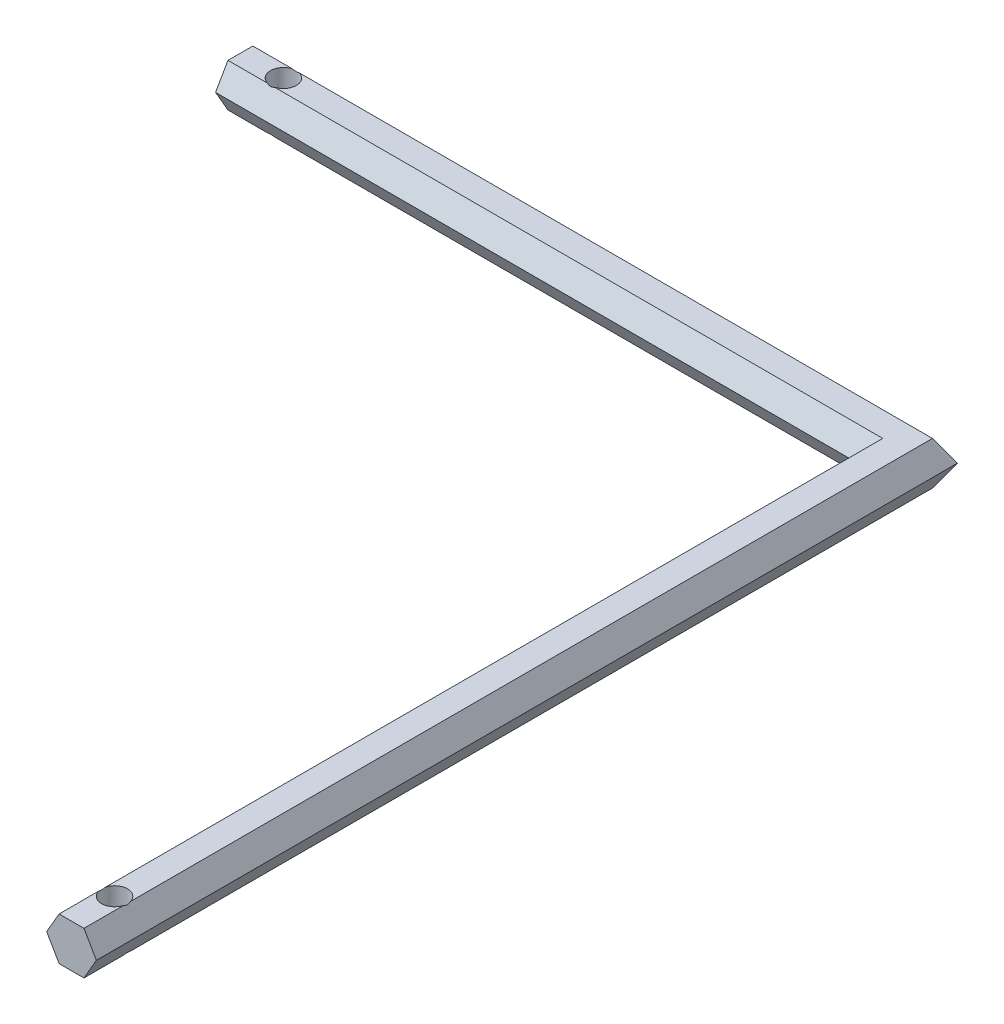
ISO-10303-21;
HEADER;
FILE_DESCRIPTION(('STEP AP214'),'2;1');
FILE_NAME('part.step','',(''),(''),'','','');
FILE_SCHEMA(('AUTOMOTIVE_DESIGN { 1 0 10303 214 1 1 1 1 }'));
ENDSEC;
DATA;
#1=APPLICATION_CONTEXT('core data for automotive mechanical design processes');
#2=APPLICATION_PROTOCOL_DEFINITION('international standard','automotive_design',2000,#1);
#3=PRODUCT_CONTEXT('',#1,'mechanical');
#4=PRODUCT('Part','Part','',(#3));
#5=PRODUCT_RELATED_PRODUCT_CATEGORY('part','',(#4));
#6=PRODUCT_DEFINITION_FORMATION('','',#4);
#7=PRODUCT_DEFINITION_CONTEXT('part definition',#1,'design');
#8=PRODUCT_DEFINITION('design','',#6,#7);
#9=PRODUCT_DEFINITION_SHAPE('','',#8);
#10=(LENGTH_UNIT() NAMED_UNIT(*) SI_UNIT(.MILLI.,.METRE.));
#11=(NAMED_UNIT(*) PLANE_ANGLE_UNIT() SI_UNIT($,.RADIAN.));
#12=(NAMED_UNIT(*) SI_UNIT($,.STERADIAN.) SOLID_ANGLE_UNIT());
#13=UNCERTAINTY_MEASURE_WITH_UNIT(LENGTH_MEASURE(1.E-05),#10,'distance_accuracy_value','');
#14=(GEOMETRIC_REPRESENTATION_CONTEXT(3) GLOBAL_UNCERTAINTY_ASSIGNED_CONTEXT((#13)) GLOBAL_UNIT_ASSIGNED_CONTEXT((#10,
#11,#12)) REPRESENTATION_CONTEXT('',''));
#15=CARTESIAN_POINT('',(0.,0.,0.));
#16=DIRECTION('',(0.,0.,1.));
#17=DIRECTION('',(1.,0.,0.));
#18=AXIS2_PLACEMENT_3D('',#15,#16,#17);
#19=CARTESIAN_POINT('',(-2.88675134594812,-5.00000000000001,100.));
#20=DIRECTION('',(0.,1.,0.));
#21=DIRECTION('',(-1.,0.,0.));
#22=AXIS2_PLACEMENT_3D('',#19,#20,#21);
#23=PLANE('',#22);
#24=DIRECTION('',(0.,0.,-1.));
#25=VECTOR('',#24,1.);
#26=CARTESIAN_POINT('',(-2.88675134594812,-5.00000000000001,100.));
#27=LINE('',#26,#25);
#28=CARTESIAN_POINT('',(-2.88675134594812,-5.00000000000001,100.));
#29=VERTEX_POINT('',#28);
#30=CARTESIAN_POINT('',(-2.88675134594812,-5.00000000000001,90.8164965809277));
#31=VERTEX_POINT('',#30);
#32=EDGE_CURVE('E358',#29,#31,#27,.T.);
#33=ORIENTED_EDGE('',*,*,#32,.T.);
#34=CARTESIAN_POINT('',(0.,-5.,90.));
#35=DIRECTION('',(0.,1.,0.));
#36=DIRECTION('',(-1.,0.,0.));
#37=AXIS2_PLACEMENT_3D('',#34,#35,#36);
#38=CIRCLE('',#37,3.);
#39=CARTESIAN_POINT('',(2.88675134594815,-4.99999999999999,90.8164965809277));
#40=VERTEX_POINT('',#39);
#41=EDGE_CURVE('E447',#31,#40,#38,.T.);
#42=ORIENTED_EDGE('',*,*,#41,.T.);
#43=DIRECTION('',(0.,0.,-1.));
#44=VECTOR('',#43,1.);
#45=CARTESIAN_POINT('',(2.88675134594815,-4.99999999999999,100.));
#46=LINE('',#45,#44);
#47=CARTESIAN_POINT('',(2.88675134594815,-4.99999999999999,100.));
#48=VERTEX_POINT('',#47);
#49=EDGE_CURVE('E352',#48,#40,#46,.T.);
#50=ORIENTED_EDGE('',*,*,#49,.F.);
#51=DIRECTION('',(1.,0.,0.));
#52=VECTOR('',#51,1.);
#53=CARTESIAN_POINT('',(-2.88675134594812,-5.00000000000001,100.));
#54=LINE('',#53,#52);
#55=EDGE_CURVE('E406',#29,#48,#54,.T.);
#56=ORIENTED_EDGE('',*,*,#55,.F.);
#57=EDGE_LOOP('',(#33,#42,#50,#56));
#58=FACE_BOUND('',#57,.T.);
#59=ADVANCED_FACE('F51',(#58),#23,.F.);
#60=CARTESIAN_POINT('',(2.88675134594815,-4.99999999999999,89.1835034190723));
#61=VERTEX_POINT('',#60);
#62=CARTESIAN_POINT('',(2.88675134594814,-5.00000000000001,-97.1132486540519));
#63=VERTEX_POINT('',#62);
#64=EDGE_CURVE('E351',#61,#63,#46,.T.);
#65=ORIENTED_EDGE('',*,*,#64,.F.);
#66=CARTESIAN_POINT('',(-2.88675134594812,-5.00000000000001,89.1835034190723));
#67=VERTEX_POINT('',#66);
#68=EDGE_CURVE('E70',#61,#67,#38,.T.);
#69=ORIENTED_EDGE('',*,*,#68,.T.);
#70=CARTESIAN_POINT('',(-2.88675134594811,-5.00000000000001,-91.3397459621557));
#71=VERTEX_POINT('',#70);
#72=EDGE_CURVE('E55',#67,#71,#27,.T.);
#73=ORIENTED_EDGE('',*,*,#72,.T.);
#74=DIRECTION('',(1.,0.,0.));
#75=VECTOR('',#74,1.);
#76=CARTESIAN_POINT('',(-154.999999999999,-5.00000000000002,-91.3397459621568));
#77=LINE('',#76,#75);
#78=CARTESIAN_POINT('',(-144.183503419071,-5.00000000000052,-91.3397459621567));
#79=VERTEX_POINT('',#78);
#80=EDGE_CURVE('E238',#79,#71,#77,.T.);
#81=ORIENTED_EDGE('',*,*,#80,.F.);
#82=CARTESIAN_POINT('',(-145.,-5.00000000000052,-94.2264973081045));
#83=DIRECTION('',(0.,1.,0.));
#84=DIRECTION('',(-1.,0.,0.));
#85=AXIS2_PLACEMENT_3D('',#82,#83,#84);
#86=CIRCLE('',#85,2.99999999999999);
#87=CARTESIAN_POINT('',(-144.183503419073,-5.00000000000002,-97.1132486540529));
#88=VERTEX_POINT('',#87);
#89=EDGE_CURVE('E453',#79,#88,#86,.T.);
#90=ORIENTED_EDGE('',*,*,#89,.T.);
#91=DIRECTION('',(1.,0.,0.));
#92=VECTOR('',#91,1.);
#93=CARTESIAN_POINT('',(-154.999999999999,-5.00000000000002,-97.113248654053));
#94=LINE('',#93,#92);
#95=EDGE_CURVE('E231',#88,#63,#94,.T.);
#96=ORIENTED_EDGE('',*,*,#95,.T.);
#97=EDGE_LOOP('',(#65,#69,#73,#81,#90,#96));
#98=FACE_BOUND('',#97,.T.);
#99=ADVANCED_FACE('F294',(#98),#23,.F.);
#100=CARTESIAN_POINT('',(2.88675134594808,5.00000000000003,100.));
#101=DIRECTION('',(0.,-1.,0.));
#102=DIRECTION('',(1.,0.,0.));
#103=AXIS2_PLACEMENT_3D('',#100,#101,#102);
#104=PLANE('',#103);
#105=DIRECTION('',(0.,0.,-1.));
#106=VECTOR('',#105,1.);
#107=CARTESIAN_POINT('',(2.88675134594808,5.00000000000003,100.));
#108=LINE('',#107,#106);
#109=CARTESIAN_POINT('',(2.88675134594808,5.00000000000003,100.));
#110=VERTEX_POINT('',#109);
#111=CARTESIAN_POINT('',(2.88675134594808,5.00000000000003,90.816496580928));
#112=VERTEX_POINT('',#111);
#113=EDGE_CURVE('E339',#110,#112,#108,.T.);
#114=ORIENTED_EDGE('',*,*,#113,.T.);
#115=CARTESIAN_POINT('',(0.,5.,90.));
#116=DIRECTION('',(0.,-1.,0.));
#117=DIRECTION('',(1.,0.,0.));
#118=AXIS2_PLACEMENT_3D('',#115,#116,#117);
#119=CIRCLE('',#118,3.);
#120=CARTESIAN_POINT('',(-2.88675134594819,4.99999999999997,90.8164965809274));
#121=VERTEX_POINT('',#120);
#122=EDGE_CURVE('E12',#112,#121,#119,.T.);
#123=ORIENTED_EDGE('',*,*,#122,.T.);
#124=DIRECTION('',(0.,0.,-1.));
#125=VECTOR('',#124,1.);
#126=CARTESIAN_POINT('',(-2.88675134594819,4.99999999999997,100.));
#127=LINE('',#126,#125);
#128=CARTESIAN_POINT('',(-2.88675134594819,4.99999999999997,100.));
#129=VERTEX_POINT('',#128);
#130=EDGE_CURVE('E340',#129,#121,#127,.T.);
#131=ORIENTED_EDGE('',*,*,#130,.F.);
#132=DIRECTION('',(-1.,0.,0.));
#133=VECTOR('',#132,1.);
#134=CARTESIAN_POINT('',(2.88675134594808,5.00000000000003,100.));
#135=LINE('',#134,#133);
#136=EDGE_CURVE('E421',#110,#129,#135,.T.);
#137=ORIENTED_EDGE('',*,*,#136,.F.);
#138=EDGE_LOOP('',(#114,#123,#131,#137));
#139=FACE_BOUND('',#138,.T.);
#140=ADVANCED_FACE('F281',(#139),#104,.F.);
#141=DIRECTION('',(1.,0.,0.));
#142=VECTOR('',#141,1.);
#143=CARTESIAN_POINT('',(-154.999999999999,4.99999999999999,-91.3397459621568));
#144=LINE('',#143,#142);
#145=CARTESIAN_POINT('',(-154.999999999999,4.99999999999999,-91.3397459621568));
#146=VERTEX_POINT('',#145);
#147=CARTESIAN_POINT('',(-145.816496580929,4.99999999999849,-91.3397459621567));
#148=VERTEX_POINT('',#147);
#149=EDGE_CURVE('E195',#146,#148,#144,.T.);
#150=ORIENTED_EDGE('',*,*,#149,.T.);
#151=CARTESIAN_POINT('',(-145.,4.99999999999849,-94.2264973081045));
#152=DIRECTION('',(0.,-1.,0.));
#153=DIRECTION('',(1.,0.,0.));
#154=AXIS2_PLACEMENT_3D('',#151,#152,#153);
#155=CIRCLE('',#154,2.99999999999999);
#156=CARTESIAN_POINT('',(-145.816496580926,4.99999999999999,-97.113248654053));
#157=VERTEX_POINT('',#156);
#158=EDGE_CURVE('E176',#148,#157,#155,.T.);
#159=ORIENTED_EDGE('',*,*,#158,.T.);
#160=DIRECTION('',(1.,0.,0.));
#161=VECTOR('',#160,1.);
#162=CARTESIAN_POINT('',(-154.999999999999,4.99999999999999,-97.113248654053));
#163=LINE('',#162,#161);
#164=CARTESIAN_POINT('',(-154.999999999999,4.99999999999999,-97.113248654053));
#165=VERTEX_POINT('',#164);
#166=EDGE_CURVE('E192',#165,#157,#163,.T.);
#167=ORIENTED_EDGE('',*,*,#166,.F.);
#168=DIRECTION('',(0.,0.,-1.));
#169=VECTOR('',#168,1.);
#170=CARTESIAN_POINT('',(-154.999999999999,4.99999999999999,-91.3397459621568));
#171=LINE('',#170,#169);
#172=EDGE_CURVE('E305',#146,#165,#171,.T.);
#173=ORIENTED_EDGE('',*,*,#172,.F.);
#174=EDGE_LOOP('',(#150,#159,#167,#173));
#175=FACE_BOUND('',#174,.T.);
#176=ADVANCED_FACE('F190',(#175),#104,.F.);
#177=CARTESIAN_POINT('',(-2.88675134594819,4.99999999999997,100.));
#178=DIRECTION('',(0.866025403784442,-0.499999999999995,0.));
#179=DIRECTION('',(0.499999999999995,0.866025403784442,0.));
#180=AXIS2_PLACEMENT_3D('',#177,#178,#179);
#181=PLANE('',#180);
#182=ORIENTED_EDGE('',*,*,#130,.T.);
#183=CARTESIAN_POINT('',(0.,10.0000000000002,90.));
#184=DIRECTION('',(0.866025403784442,-0.499999999999995,0.));
#185=DIRECTION('',(0.499999999999995,0.866025403784442,0.));
#186=AXIS2_PLACEMENT_3D('',#183,#184,#185);
#187=ELLIPSE('',#186,6.00000000000006,3.);
#188=CARTESIAN_POINT('',(-2.88675134594819,4.99999999999997,89.1835034190726));
#189=VERTEX_POINT('',#188);
#190=EDGE_CURVE('E432',#121,#189,#187,.T.);
#191=ORIENTED_EDGE('',*,*,#190,.T.);
#192=CARTESIAN_POINT('',(-2.88675134594819,4.99999999999997,-91.3397459621556));
#193=VERTEX_POINT('',#192);
#194=EDGE_CURVE('E341',#189,#193,#127,.T.);
#195=ORIENTED_EDGE('',*,*,#194,.T.);
#196=DIRECTION('',(-0.447213595499956,-0.77459666924149,0.447213595499949));
#197=VECTOR('',#196,1.);
#198=CARTESIAN_POINT('',(-2.88675134594819,4.99999999999996,-91.3397459621557));
#199=LINE('',#198,#197);
#200=CARTESIAN_POINT('',(-5.77350269189626,0.,-88.4529946162077));
#201=VERTEX_POINT('',#200);
#202=EDGE_CURVE('E381',#193,#201,#199,.T.);
#203=ORIENTED_EDGE('',*,*,#202,.T.);
#204=DIRECTION('',(0.,0.,-1.));
#205=VECTOR('',#204,1.);
#206=CARTESIAN_POINT('',(-5.77350269189626,0.,100.));
#207=LINE('',#206,#205);
#208=CARTESIAN_POINT('',(-5.77350269189626,0.,100.));
#209=VERTEX_POINT('',#208);
#210=EDGE_CURVE('E185',#209,#201,#207,.T.);
#211=ORIENTED_EDGE('',*,*,#210,.F.);
#212=DIRECTION('',(-0.499999999999995,-0.866025403784442,0.));
#213=VECTOR('',#212,1.);
#214=CARTESIAN_POINT('',(-2.88675134594819,4.99999999999997,100.));
#215=LINE('',#214,#213);
#216=EDGE_CURVE('E393',#129,#209,#215,.T.);
#217=ORIENTED_EDGE('',*,*,#216,.F.);
#218=EDGE_LOOP('',(#182,#191,#195,#203,#211,#217));
#219=FACE_BOUND('',#218,.T.);
#220=ADVANCED_FACE('F53',(#219),#181,.F.);
#221=CARTESIAN_POINT('',(-5.77350269189626,0.,100.));
#222=DIRECTION('',(0.866025403784438,0.500000000000001,0.));
#223=DIRECTION('',(-0.500000000000001,0.866025403784438,0.));
#224=AXIS2_PLACEMENT_3D('',#221,#222,#223);
#225=PLANE('',#224);
#226=ORIENTED_EDGE('',*,*,#72,.F.);
#227=CARTESIAN_POINT('',(0.,-10.,90.));
#228=DIRECTION('',(0.866025403784438,0.500000000000001,0.));
#229=DIRECTION('',(-0.500000000000001,0.866025403784438,0.));
#230=AXIS2_PLACEMENT_3D('',#227,#228,#229);
#231=ELLIPSE('',#230,5.99999999999999,3.);
#232=EDGE_CURVE('E309',#67,#31,#231,.T.);
#233=ORIENTED_EDGE('',*,*,#232,.T.);
#234=ORIENTED_EDGE('',*,*,#32,.F.);
#235=DIRECTION('',(0.500000000000001,-0.866025403784438,0.));
#236=VECTOR('',#235,1.);
#237=CARTESIAN_POINT('',(-5.77350269189626,0.,100.));
#238=LINE('',#237,#236);
#239=EDGE_CURVE('E402',#209,#29,#238,.T.);
#240=ORIENTED_EDGE('',*,*,#239,.F.);
#241=ORIENTED_EDGE('',*,*,#210,.T.);
#242=DIRECTION('',(0.447213595499959,-0.774596669241484,-0.447213595499955));
#243=VECTOR('',#242,1.);
#244=CARTESIAN_POINT('',(-5.77350269189626,0.,-88.4529946162076));
#245=LINE('',#244,#243);
#246=EDGE_CURVE('E377',#201,#71,#245,.T.);
#247=ORIENTED_EDGE('',*,*,#246,.T.);
#248=EDGE_LOOP('',(#226,#233,#234,#240,#241,#247));
#249=FACE_BOUND('',#248,.T.);
#250=ADVANCED_FACE('F292',(#249),#225,.F.);
#251=CARTESIAN_POINT('',(-154.999999999999,-5.00000000000002,-97.113248654053));
#252=VERTEX_POINT('',#251);
#253=CARTESIAN_POINT('',(-145.816496580927,-5.00000000000002,-97.1132486540529));
#254=VERTEX_POINT('',#253);
#255=EDGE_CURVE('E236',#252,#254,#94,.T.);
#256=ORIENTED_EDGE('',*,*,#255,.T.);
#257=CARTESIAN_POINT('',(-145.816496580929,-5.00000000000052,-91.3397459621567));
#258=VERTEX_POINT('',#257);
#259=EDGE_CURVE('E458',#254,#258,#86,.T.);
#260=ORIENTED_EDGE('',*,*,#259,.T.);
#261=CARTESIAN_POINT('',(-154.999999999999,-5.00000000000002,-91.3397459621568));
#262=VERTEX_POINT('',#261);
#263=EDGE_CURVE('E237',#262,#258,#77,.T.);
#264=ORIENTED_EDGE('',*,*,#263,.F.);
#265=DIRECTION('',(0.,0.,1.));
#266=VECTOR('',#265,1.);
#267=CARTESIAN_POINT('',(-154.999999999999,-5.00000000000002,-97.113248654053));
#268=LINE('',#267,#266);
#269=EDGE_CURVE('E464',#252,#262,#268,.T.);
#270=ORIENTED_EDGE('',*,*,#269,.F.);
#271=EDGE_LOOP('',(#256,#260,#264,#270));
#272=FACE_BOUND('',#271,.T.);
#273=ADVANCED_FACE('F288',(#272),#23,.F.);
#274=CARTESIAN_POINT('',(2.88675134594815,-4.99999999999999,100.));
#275=DIRECTION('',(-0.866025403784442,0.499999999999995,0.));
#276=DIRECTION('',(-0.499999999999995,-0.866025403784442,0.));
#277=AXIS2_PLACEMENT_3D('',#274,#275,#276);
#278=PLANE('',#277);
#279=ORIENTED_EDGE('',*,*,#49,.T.);
#280=CARTESIAN_POINT('',(0.,-10.,90.));
#281=DIRECTION('',(-0.866025403784442,0.499999999999995,0.));
#282=DIRECTION('',(0.499999999999995,0.866025403784442,0.));
#283=AXIS2_PLACEMENT_3D('',#280,#281,#282);
#284=ELLIPSE('',#283,6.00000000000006,3.);
#285=EDGE_CURVE('E448',#40,#61,#284,.T.);
#286=ORIENTED_EDGE('',*,*,#285,.T.);
#287=ORIENTED_EDGE('',*,*,#64,.T.);
#288=DIRECTION('',(0.447213595499955,0.774596669241488,-0.447213595499953));
#289=VECTOR('',#288,1.);
#290=CARTESIAN_POINT('',(2.88675134594814,-5.,-97.113248654052));
#291=LINE('',#290,#289);
#292=CARTESIAN_POINT('',(5.77350269189626,0.,-100.));
#293=VERTEX_POINT('',#292);
#294=EDGE_CURVE('E211',#63,#293,#291,.T.);
#295=ORIENTED_EDGE('',*,*,#294,.T.);
#296=DIRECTION('',(0.,0.,-1.));
#297=VECTOR('',#296,1.);
#298=CARTESIAN_POINT('',(5.77350269189626,0.,100.));
#299=LINE('',#298,#297);
#300=CARTESIAN_POINT('',(5.77350269189626,0.,100.));
#301=VERTEX_POINT('',#300);
#302=EDGE_CURVE('E346',#301,#293,#299,.T.);
#303=ORIENTED_EDGE('',*,*,#302,.F.);
#304=DIRECTION('',(0.499999999999995,0.866025403784441,0.));
#305=VECTOR('',#304,1.);
#306=CARTESIAN_POINT('',(2.88675134594815,-4.99999999999999,100.));
#307=LINE('',#306,#305);
#308=EDGE_CURVE('E415',#48,#301,#307,.T.);
#309=ORIENTED_EDGE('',*,*,#308,.F.);
#310=EDGE_LOOP('',(#279,#286,#287,#295,#303,#309));
#311=FACE_BOUND('',#310,.T.);
#312=ADVANCED_FACE('F284',(#311),#278,.F.);
#313=CARTESIAN_POINT('',(5.77350269189626,0.,100.));
#314=DIRECTION('',(-0.866025403784435,-0.500000000000007,0.));
#315=DIRECTION('',(0.500000000000007,-0.866025403784435,0.));
#316=AXIS2_PLACEMENT_3D('',#313,#314,#315);
#317=PLANE('',#316);
#318=CARTESIAN_POINT('',(2.88675134594808,5.00000000000003,89.183503419072));
#319=VERTEX_POINT('',#318);
#320=CARTESIAN_POINT('',(2.88675134594807,5.00000000000003,-97.1132486540519));
#321=VERTEX_POINT('',#320);
#322=EDGE_CURVE('E335',#319,#321,#108,.T.);
#323=ORIENTED_EDGE('',*,*,#322,.F.);
#324=CARTESIAN_POINT('',(0.,9.99999999999981,90.));
#325=DIRECTION('',(-0.866025403784435,-0.500000000000007,0.));
#326=DIRECTION('',(-0.500000000000007,0.866025403784435,0.));
#327=AXIS2_PLACEMENT_3D('',#324,#325,#326);
#328=ELLIPSE('',#327,5.99999999999992,3.);
#329=EDGE_CURVE('E78',#319,#112,#328,.T.);
#330=ORIENTED_EDGE('',*,*,#329,.T.);
#331=ORIENTED_EDGE('',*,*,#113,.F.);
#332=DIRECTION('',(-0.500000000000007,0.866025403784435,0.));
#333=VECTOR('',#332,1.);
#334=CARTESIAN_POINT('',(5.77350269189626,0.,100.));
#335=LINE('',#334,#333);
#336=EDGE_CURVE('E418',#301,#110,#335,.T.);
#337=ORIENTED_EDGE('',*,*,#336,.F.);
#338=ORIENTED_EDGE('',*,*,#302,.T.);
#339=DIRECTION('',(-0.447213595499964,0.774596669241479,0.44721359549996));
#340=VECTOR('',#339,1.);
#341=CARTESIAN_POINT('',(5.77350269189625,0.,-100.));
#342=LINE('',#341,#340);
#343=EDGE_CURVE('E205',#293,#321,#342,.T.);
#344=ORIENTED_EDGE('',*,*,#343,.T.);
#345=EDGE_LOOP('',(#323,#330,#331,#337,#338,#344));
#346=FACE_BOUND('',#345,.T.);
#347=ADVANCED_FACE('F279',(#346),#317,.F.);
#348=ORIENTED_EDGE('',*,*,#194,.F.);
#349=EDGE_CURVE('E62',#189,#319,#119,.T.);
#350=ORIENTED_EDGE('',*,*,#349,.T.);
#351=ORIENTED_EDGE('',*,*,#322,.T.);
#352=CARTESIAN_POINT('',(-144.183503419073,5.,-97.1132486540529));
#353=VERTEX_POINT('',#352);
#354=EDGE_CURVE('E206',#353,#321,#163,.T.);
#355=ORIENTED_EDGE('',*,*,#354,.F.);
#356=CARTESIAN_POINT('',(-144.183503419071,4.99999999999849,-91.3397459621567));
#357=VERTEX_POINT('',#356);
#358=EDGE_CURVE('E179',#353,#357,#155,.T.);
#359=ORIENTED_EDGE('',*,*,#358,.T.);
#360=EDGE_CURVE('E319',#357,#193,#144,.T.);
#361=ORIENTED_EDGE('',*,*,#360,.T.);
#362=EDGE_LOOP('',(#348,#350,#351,#355,#359,#361));
#363=FACE_BOUND('',#362,.T.);
#364=ADVANCED_FACE('F274',(#363),#104,.F.);
#365=CARTESIAN_POINT('',(0.,0.,100.));
#366=DIRECTION('',(0.,0.,1.));
#367=DIRECTION('',(1.,0.,0.));
#368=AXIS2_PLACEMENT_3D('',#365,#366,#367);
#369=PLANE('',#368);
#370=ORIENTED_EDGE('',*,*,#216,.T.);
#371=ORIENTED_EDGE('',*,*,#239,.T.);
#372=ORIENTED_EDGE('',*,*,#55,.T.);
#373=ORIENTED_EDGE('',*,*,#308,.T.);
#374=ORIENTED_EDGE('',*,*,#336,.T.);
#375=ORIENTED_EDGE('',*,*,#136,.T.);
#376=EDGE_LOOP('',(#370,#371,#372,#373,#374,#375));
#377=FACE_BOUND('',#376,.T.);
#378=ADVANCED_FACE('F271',(#377),#369,.T.);
#379=CARTESIAN_POINT('',(-155.,-4.30211422042252E-13,-7.45148040973631E-13));
#380=DIRECTION('',(-1.,0.,0.));
#381=DIRECTION('',(0.,0.,1.));
#382=AXIS2_PLACEMENT_3D('',#379,#380,#381);
#383=PLANE('',#382);
#384=ORIENTED_EDGE('',*,*,#172,.T.);
#385=DIRECTION('',(0.,-0.866025403784439,-0.5));
#386=VECTOR('',#385,1.);
#387=CARTESIAN_POINT('',(-154.999999999999,4.99999999999999,-97.113248654053));
#388=LINE('',#387,#386);
#389=CARTESIAN_POINT('',(-154.999999999999,0.,-100.000000000001));
#390=VERTEX_POINT('',#389);
#391=EDGE_CURVE('E202',#165,#390,#388,.T.);
#392=ORIENTED_EDGE('',*,*,#391,.T.);
#393=DIRECTION('',(0.,-0.866025403784438,0.5));
#394=VECTOR('',#393,1.);
#395=CARTESIAN_POINT('',(-154.999999999999,0.,-100.000000000001));
#396=LINE('',#395,#394);
#397=EDGE_CURVE('E250',#390,#252,#396,.T.);
#398=ORIENTED_EDGE('',*,*,#397,.T.);
#399=ORIENTED_EDGE('',*,*,#269,.T.);
#400=DIRECTION('',(0.,0.866025403784439,0.5));
#401=VECTOR('',#400,1.);
#402=CARTESIAN_POINT('',(-154.999999999999,-5.00000000000002,-91.3397459621568));
#403=LINE('',#402,#401);
#404=CARTESIAN_POINT('',(-154.999999999999,0.,-88.4529946162086));
#405=VERTEX_POINT('',#404);
#406=EDGE_CURVE('E478',#262,#405,#403,.T.);
#407=ORIENTED_EDGE('',*,*,#406,.T.);
#408=DIRECTION('',(0.,0.866025403784439,-0.5));
#409=VECTOR('',#408,1.);
#410=CARTESIAN_POINT('',(-154.999999999999,0.,-88.4529946162086));
#411=LINE('',#410,#409);
#412=EDGE_CURVE('E314',#405,#146,#411,.T.);
#413=ORIENTED_EDGE('',*,*,#412,.T.);
#414=EDGE_LOOP('',(#384,#392,#398,#399,#407,#413));
#415=FACE_BOUND('',#414,.T.);
#416=ADVANCED_FACE('F273',(#415),#383,.T.);
#417=CARTESIAN_POINT('',(4.68879984496032E-13,-38.301270189222,-66.3397459621557));
#418=DIRECTION('',(0.,0.5,0.866025403784439));
#419=DIRECTION('',(0.,-0.866025403784439,0.5));
#420=AXIS2_PLACEMENT_3D('',#417,#418,#419);
#421=PLANE('',#420);
#422=CARTESIAN_POINT('',(-145.,9.99999999999946,-94.2264973081045));
#423=DIRECTION('',(0.,0.5,0.866025403784439));
#424=DIRECTION('',(0.,0.866025403784439,-0.5));
#425=AXIS2_PLACEMENT_3D('',#422,#423,#424);
#426=ELLIPSE('',#425,5.99999999999999,2.99999999999999);
#427=EDGE_CURVE('E197',#148,#357,#426,.T.);
#428=ORIENTED_EDGE('',*,*,#427,.F.);
#429=ORIENTED_EDGE('',*,*,#149,.F.);
#430=ORIENTED_EDGE('',*,*,#412,.F.);
#431=DIRECTION('',(1.,0.,0.));
#432=VECTOR('',#431,1.);
#433=CARTESIAN_POINT('',(-154.999999999999,0.,-88.4529946162086));
#434=LINE('',#433,#432);
#435=EDGE_CURVE('E325',#405,#201,#434,.T.);
#436=ORIENTED_EDGE('',*,*,#435,.T.);
#437=ORIENTED_EDGE('',*,*,#202,.F.);
#438=ORIENTED_EDGE('',*,*,#360,.F.);
#439=EDGE_LOOP('',(#428,#429,#430,#436,#437,#438));
#440=FACE_BOUND('',#439,.T.);
#441=ADVANCED_FACE('F313',(#440),#421,.T.);
#442=CARTESIAN_POINT('',(4.6341337529963E-13,38.301270189222,-66.3397459621557));
#443=DIRECTION('',(0.,-0.5,0.866025403784439));
#444=DIRECTION('',(0.,-0.866025403784439,-0.5));
#445=AXIS2_PLACEMENT_3D('',#442,#443,#444);
#446=PLANE('',#445);
#447=CARTESIAN_POINT('',(-145.,-9.99999999999943,-94.2264973081045));
#448=DIRECTION('',(0.,-0.5,0.866025403784439));
#449=DIRECTION('',(0.,0.866025403784439,0.5));
#450=AXIS2_PLACEMENT_3D('',#447,#448,#449);
#451=ELLIPSE('',#450,5.99999999999999,2.99999999999999);
#452=EDGE_CURVE('E477',#79,#258,#451,.T.);
#453=ORIENTED_EDGE('',*,*,#452,.F.);
#454=ORIENTED_EDGE('',*,*,#80,.T.);
#455=ORIENTED_EDGE('',*,*,#246,.F.);
#456=ORIENTED_EDGE('',*,*,#435,.F.);
#457=ORIENTED_EDGE('',*,*,#406,.F.);
#458=ORIENTED_EDGE('',*,*,#263,.T.);
#459=EDGE_LOOP('',(#453,#454,#455,#456,#457,#458));
#460=FACE_BOUND('',#459,.T.);
#461=ADVANCED_FACE('F265',(#460),#446,.T.);
#462=CARTESIAN_POINT('',(5.30024399744124E-13,-43.301270189222,-75.));
#463=DIRECTION('',(0.,-0.5,-0.866025403784439));
#464=DIRECTION('',(0.,0.866025403784439,-0.5));
#465=AXIS2_PLACEMENT_3D('',#462,#463,#464);
#466=PLANE('',#465);
#467=CARTESIAN_POINT('',(-145.,-10.0000000000005,-94.2264973081045));
#468=DIRECTION('',(0.,-0.5,-0.866025403784439));
#469=DIRECTION('',(0.,0.866025403784439,-0.5));
#470=AXIS2_PLACEMENT_3D('',#467,#468,#469);
#471=ELLIPSE('',#470,5.99999999999999,2.99999999999999);
#472=EDGE_CURVE('E454',#254,#88,#471,.T.);
#473=ORIENTED_EDGE('',*,*,#472,.F.);
#474=ORIENTED_EDGE('',*,*,#255,.F.);
#475=ORIENTED_EDGE('',*,*,#397,.F.);
#476=DIRECTION('',(1.,0.,0.));
#477=VECTOR('',#476,1.);
#478=CARTESIAN_POINT('',(-154.999999999999,0.,-100.000000000001));
#479=LINE('',#478,#477);
#480=EDGE_CURVE('E213',#390,#293,#479,.T.);
#481=ORIENTED_EDGE('',*,*,#480,.T.);
#482=ORIENTED_EDGE('',*,*,#294,.F.);
#483=ORIENTED_EDGE('',*,*,#95,.F.);
#484=EDGE_LOOP('',(#473,#474,#475,#481,#482,#483));
#485=FACE_BOUND('',#484,.T.);
#486=ADVANCED_FACE('F256',(#485),#466,.T.);
#487=CARTESIAN_POINT('',(5.44474477577304E-13,43.3012701892219,-75.0000000000001));
#488=DIRECTION('',(0.,0.5,-0.866025403784439));
#489=DIRECTION('',(0.,0.866025403784439,0.5));
#490=AXIS2_PLACEMENT_3D('',#487,#488,#489);
#491=PLANE('',#490);
#492=CARTESIAN_POINT('',(-145.,10.0000000000005,-94.2264973081045));
#493=DIRECTION('',(0.,0.5,-0.866025403784439));
#494=DIRECTION('',(0.,0.866025403784439,0.5));
#495=AXIS2_PLACEMENT_3D('',#492,#493,#494);
#496=ELLIPSE('',#495,5.99999999999999,2.99999999999999);
#497=EDGE_CURVE('E173',#353,#157,#496,.T.);
#498=ORIENTED_EDGE('',*,*,#497,.F.);
#499=ORIENTED_EDGE('',*,*,#354,.T.);
#500=ORIENTED_EDGE('',*,*,#343,.F.);
#501=ORIENTED_EDGE('',*,*,#480,.F.);
#502=ORIENTED_EDGE('',*,*,#391,.F.);
#503=ORIENTED_EDGE('',*,*,#166,.T.);
#504=EDGE_LOOP('',(#498,#499,#500,#501,#502,#503));
#505=FACE_BOUND('',#504,.T.);
#506=ADVANCED_FACE('F199',(#505),#491,.T.);
#507=CARTESIAN_POINT('',(-145.,-5.00010000000002,-94.2264973081045));
#508=DIRECTION('',(0.,1.,0.));
#509=DIRECTION('',(0.,0.,1.));
#510=AXIS2_PLACEMENT_3D('',#507,#508,#509);
#511=CYLINDRICAL_SURFACE('',#510,2.99999999999999);
#512=ORIENTED_EDGE('',*,*,#452,.T.);
#513=ORIENTED_EDGE('',*,*,#259,.F.);
#514=ORIENTED_EDGE('',*,*,#472,.T.);
#515=ORIENTED_EDGE('',*,*,#89,.F.);
#516=EDGE_LOOP('',(#512,#513,#514,#515));
#517=FACE_BOUND('',#516,.T.);
#518=ORIENTED_EDGE('',*,*,#427,.T.);
#519=ORIENTED_EDGE('',*,*,#358,.F.);
#520=ORIENTED_EDGE('',*,*,#497,.T.);
#521=ORIENTED_EDGE('',*,*,#158,.F.);
#522=EDGE_LOOP('',(#518,#519,#520,#521));
#523=FACE_BOUND('',#522,.T.);
#524=ADVANCED_FACE('F175',(#517,#523),#511,.F.);
#525=CARTESIAN_POINT('',(0.,-5.00010000000002,90.));
#526=DIRECTION('',(0.,1.,0.));
#527=DIRECTION('',(0.,0.,1.));
#528=AXIS2_PLACEMENT_3D('',#525,#526,#527);
#529=CYLINDRICAL_SURFACE('',#528,3.);
#530=ORIENTED_EDGE('',*,*,#329,.F.);
#531=ORIENTED_EDGE('',*,*,#349,.F.);
#532=ORIENTED_EDGE('',*,*,#190,.F.);
#533=ORIENTED_EDGE('',*,*,#122,.F.);
#534=EDGE_LOOP('',(#530,#531,#532,#533));
#535=FACE_BOUND('',#534,.T.);
#536=ORIENTED_EDGE('',*,*,#68,.F.);
#537=ORIENTED_EDGE('',*,*,#285,.F.);
#538=ORIENTED_EDGE('',*,*,#41,.F.);
#539=ORIENTED_EDGE('',*,*,#232,.F.);
#540=EDGE_LOOP('',(#536,#537,#538,#539));
#541=FACE_BOUND('',#540,.T.);
#542=ADVANCED_FACE('F559',(#535,#541),#529,.F.);
#543=CLOSED_SHELL('',(#59,#99,#140,#176,#220,#250,#273,#312,#347,#364,#378,#416,#441,#461,#486,
#506,#524,#542));
#544=MANIFOLD_SOLID_BREP('B2',#543);
#545=ADVANCED_BREP_SHAPE_REPRESENTATION('',(#18,#544),#14);
#546=SHAPE_DEFINITION_REPRESENTATION(#9,#545);
ENDSEC;
END-ISO-10303-21;
